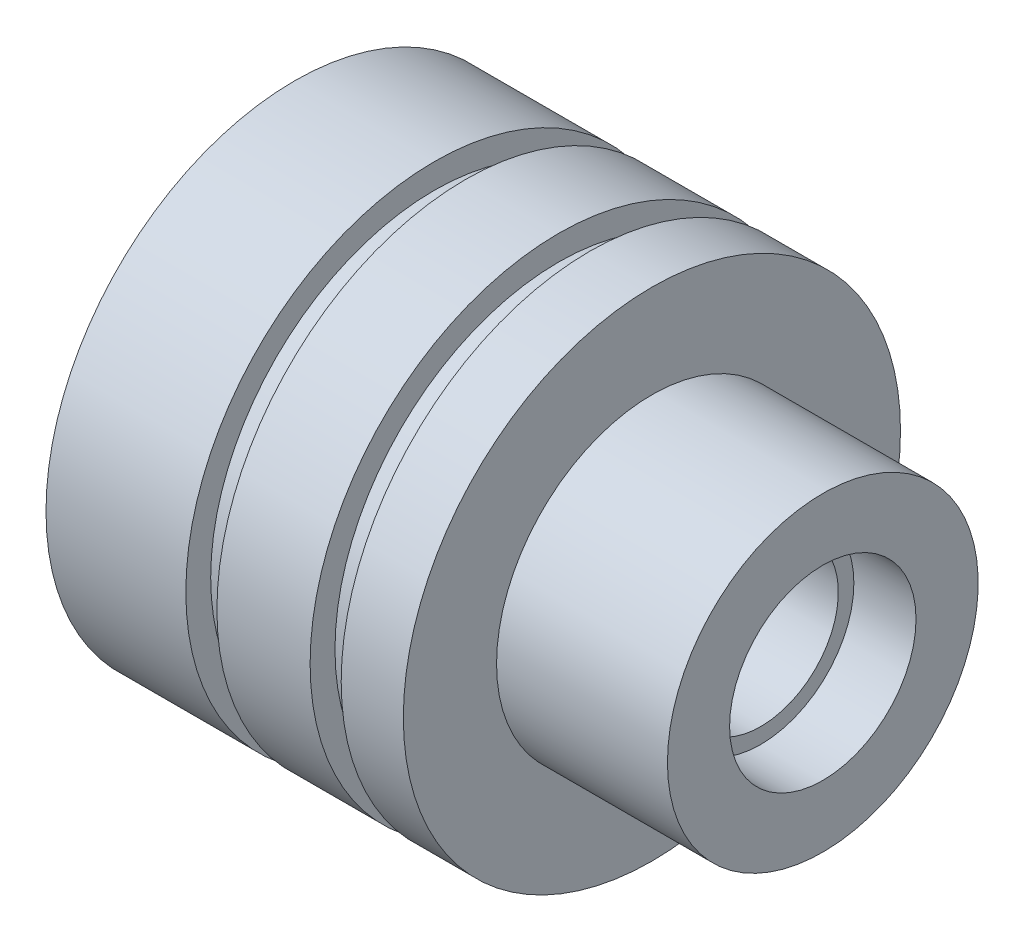
ISO-10303-21;
HEADER;
FILE_DESCRIPTION(('STEP AP214'),'2;1');
FILE_NAME('part.step','',(''),(''),'','','');
FILE_SCHEMA(('AUTOMOTIVE_DESIGN { 1 0 10303 214 1 1 1 1 }'));
ENDSEC;
DATA;
#1=APPLICATION_CONTEXT('core data for automotive mechanical design processes');
#2=APPLICATION_PROTOCOL_DEFINITION('international standard','automotive_design',2000,#1);
#3=PRODUCT_CONTEXT('',#1,'mechanical');
#4=PRODUCT('Part','Part','',(#3));
#5=PRODUCT_RELATED_PRODUCT_CATEGORY('part','',(#4));
#6=PRODUCT_DEFINITION_FORMATION('','',#4);
#7=PRODUCT_DEFINITION_CONTEXT('part definition',#1,'design');
#8=PRODUCT_DEFINITION('design','',#6,#7);
#9=PRODUCT_DEFINITION_SHAPE('','',#8);
#10=(LENGTH_UNIT() NAMED_UNIT(*) SI_UNIT(.MILLI.,.METRE.));
#11=(NAMED_UNIT(*) PLANE_ANGLE_UNIT() SI_UNIT($,.RADIAN.));
#12=(NAMED_UNIT(*) SI_UNIT($,.STERADIAN.) SOLID_ANGLE_UNIT());
#13=UNCERTAINTY_MEASURE_WITH_UNIT(LENGTH_MEASURE(1.E-05),#10,'distance_accuracy_value','');
#14=(GEOMETRIC_REPRESENTATION_CONTEXT(3) GLOBAL_UNCERTAINTY_ASSIGNED_CONTEXT((#13)) GLOBAL_UNIT_ASSIGNED_CONTEXT((#10,
#11,#12)) REPRESENTATION_CONTEXT('',''));
#15=CARTESIAN_POINT('',(0.,0.,0.));
#16=DIRECTION('',(0.,0.,1.));
#17=DIRECTION('',(1.,0.,0.));
#18=AXIS2_PLACEMENT_3D('',#15,#16,#17);
#19=CARTESIAN_POINT('',(0.,0.,0.));
#20=DIRECTION('',(-1.,0.,0.));
#21=DIRECTION('',(0.,0.,1.));
#22=AXIS2_PLACEMENT_3D('',#19,#20,#21);
#23=CYLINDRICAL_SURFACE('',#22,2.5);
#24=CARTESIAN_POINT('',(15.,0.,0.));
#25=DIRECTION('',(-1.,0.,0.));
#26=DIRECTION('',(0.,0.,1.));
#27=AXIS2_PLACEMENT_3D('',#24,#25,#26);
#28=CIRCLE('',#27,2.5);
#29=CARTESIAN_POINT('',(15.,0.,2.5));
#30=VERTEX_POINT('',#29);
#31=EDGE_CURVE('E12',#30,#30,#28,.T.);
#32=ORIENTED_EDGE('',*,*,#31,.F.);
#33=EDGE_LOOP('',(#32));
#34=FACE_BOUND('',#33,.T.);
#35=CARTESIAN_POINT('',(5.6,0.,0.));
#36=DIRECTION('',(-1.,0.,0.));
#37=DIRECTION('',(0.,0.,1.));
#38=AXIS2_PLACEMENT_3D('',#35,#36,#37);
#39=CIRCLE('',#38,2.5);
#40=CARTESIAN_POINT('',(5.6,0.,2.5));
#41=VERTEX_POINT('',#40);
#42=EDGE_CURVE('E98',#41,#41,#39,.T.);
#43=ORIENTED_EDGE('',*,*,#42,.T.);
#44=EDGE_LOOP('',(#43));
#45=FACE_BOUND('',#44,.T.);
#46=ADVANCED_FACE('F40',(#34,#45),#23,.F.);
#47=CARTESIAN_POINT('',(15.,2.5,0.));
#48=DIRECTION('',(-1.,0.,0.));
#49=DIRECTION('',(0.,0.,1.));
#50=AXIS2_PLACEMENT_3D('',#47,#48,#49);
#51=PLANE('',#50);
#52=CARTESIAN_POINT('',(15.,0.,0.));
#53=DIRECTION('',(-1.,0.,0.));
#54=DIRECTION('',(0.,0.,1.));
#55=AXIS2_PLACEMENT_3D('',#52,#53,#54);
#56=CIRCLE('',#55,3.);
#57=CARTESIAN_POINT('',(15.,0.,3.));
#58=VERTEX_POINT('',#57);
#59=EDGE_CURVE('E46',#58,#58,#56,.T.);
#60=ORIENTED_EDGE('',*,*,#59,.F.);
#61=EDGE_LOOP('',(#60));
#62=FACE_BOUND('',#61,.T.);
#63=ORIENTED_EDGE('',*,*,#31,.T.);
#64=EDGE_LOOP('',(#63));
#65=FACE_BOUND('',#64,.T.);
#66=ADVANCED_FACE('F195',(#62,#65),#51,.F.);
#67=CARTESIAN_POINT('',(0.,0.,0.));
#68=DIRECTION('',(-1.,0.,0.));
#69=DIRECTION('',(0.,0.,1.));
#70=AXIS2_PLACEMENT_3D('',#67,#68,#69);
#71=CYLINDRICAL_SURFACE('',#70,3.);
#72=CARTESIAN_POINT('',(17.,0.,0.));
#73=DIRECTION('',(-1.,0.,0.));
#74=DIRECTION('',(0.,0.,1.));
#75=AXIS2_PLACEMENT_3D('',#72,#73,#74);
#76=CIRCLE('',#75,3.);
#77=CARTESIAN_POINT('',(17.,0.,3.));
#78=VERTEX_POINT('',#77);
#79=EDGE_CURVE('E50',#78,#78,#76,.T.);
#80=ORIENTED_EDGE('',*,*,#79,.F.);
#81=EDGE_LOOP('',(#80));
#82=FACE_BOUND('',#81,.T.);
#83=ORIENTED_EDGE('',*,*,#59,.T.);
#84=EDGE_LOOP('',(#83));
#85=FACE_BOUND('',#84,.T.);
#86=ADVANCED_FACE('F190',(#82,#85),#71,.F.);
#87=CARTESIAN_POINT('',(17.,3.,0.));
#88=DIRECTION('',(-1.,0.,0.));
#89=DIRECTION('',(0.,0.,1.));
#90=AXIS2_PLACEMENT_3D('',#87,#88,#89);
#91=PLANE('',#90);
#92=CARTESIAN_POINT('',(17.,0.,0.));
#93=DIRECTION('',(-1.,0.,0.));
#94=DIRECTION('',(0.,0.,1.));
#95=AXIS2_PLACEMENT_3D('',#92,#93,#94);
#96=CIRCLE('',#95,5.);
#97=CARTESIAN_POINT('',(17.,0.,5.));
#98=VERTEX_POINT('',#97);
#99=EDGE_CURVE('E54',#98,#98,#96,.T.);
#100=ORIENTED_EDGE('',*,*,#99,.F.);
#101=EDGE_LOOP('',(#100));
#102=FACE_BOUND('',#101,.T.);
#103=ORIENTED_EDGE('',*,*,#79,.T.);
#104=EDGE_LOOP('',(#103));
#105=FACE_BOUND('',#104,.T.);
#106=ADVANCED_FACE('F184',(#102,#105),#91,.F.);
#107=CARTESIAN_POINT('',(0.,0.,0.));
#108=DIRECTION('',(-1.,0.,0.));
#109=DIRECTION('',(0.,0.,1.));
#110=AXIS2_PLACEMENT_3D('',#107,#108,#109);
#111=CYLINDRICAL_SURFACE('',#110,5.);
#112=CARTESIAN_POINT('',(11.5,0.,0.));
#113=DIRECTION('',(-1.,0.,0.));
#114=DIRECTION('',(0.,0.,1.));
#115=AXIS2_PLACEMENT_3D('',#112,#113,#114);
#116=CIRCLE('',#115,5.);
#117=CARTESIAN_POINT('',(11.5,0.,5.));
#118=VERTEX_POINT('',#117);
#119=EDGE_CURVE('E59',#118,#118,#116,.T.);
#120=ORIENTED_EDGE('',*,*,#119,.F.);
#121=EDGE_LOOP('',(#120));
#122=FACE_BOUND('',#121,.T.);
#123=ORIENTED_EDGE('',*,*,#99,.T.);
#124=EDGE_LOOP('',(#123));
#125=FACE_BOUND('',#124,.T.);
#126=ADVANCED_FACE('F178',(#122,#125),#111,.T.);
#127=CARTESIAN_POINT('',(11.5,5.,0.));
#128=DIRECTION('',(-1.,0.,0.));
#129=DIRECTION('',(0.,0.,1.));
#130=AXIS2_PLACEMENT_3D('',#127,#128,#129);
#131=PLANE('',#130);
#132=CARTESIAN_POINT('',(11.5,0.,0.));
#133=DIRECTION('',(-1.,0.,0.));
#134=DIRECTION('',(0.,0.,1.));
#135=AXIS2_PLACEMENT_3D('',#132,#133,#134);
#136=CIRCLE('',#135,8.);
#137=CARTESIAN_POINT('',(11.5,0.,8.));
#138=VERTEX_POINT('',#137);
#139=EDGE_CURVE('E62',#138,#138,#136,.T.);
#140=ORIENTED_EDGE('',*,*,#139,.F.);
#141=EDGE_LOOP('',(#140));
#142=FACE_BOUND('',#141,.T.);
#143=ORIENTED_EDGE('',*,*,#119,.T.);
#144=EDGE_LOOP('',(#143));
#145=FACE_BOUND('',#144,.T.);
#146=ADVANCED_FACE('F172',(#142,#145),#131,.F.);
#147=CARTESIAN_POINT('',(0.,0.,0.));
#148=DIRECTION('',(-1.,0.,0.));
#149=DIRECTION('',(0.,0.,1.));
#150=AXIS2_PLACEMENT_3D('',#147,#148,#149);
#151=CYLINDRICAL_SURFACE('',#150,8.);
#152=CARTESIAN_POINT('',(9.5,0.,0.));
#153=DIRECTION('',(-1.,0.,0.));
#154=DIRECTION('',(0.,0.,1.));
#155=AXIS2_PLACEMENT_3D('',#152,#153,#154);
#156=CIRCLE('',#155,8.);
#157=CARTESIAN_POINT('',(9.5,0.,8.));
#158=VERTEX_POINT('',#157);
#159=EDGE_CURVE('E65',#158,#158,#156,.T.);
#160=ORIENTED_EDGE('',*,*,#159,.F.);
#161=EDGE_LOOP('',(#160));
#162=FACE_BOUND('',#161,.T.);
#163=ORIENTED_EDGE('',*,*,#139,.T.);
#164=EDGE_LOOP('',(#163));
#165=FACE_BOUND('',#164,.T.);
#166=ADVANCED_FACE('F166',(#162,#165),#151,.T.);
#167=CARTESIAN_POINT('',(9.5,7.2,0.));
#168=DIRECTION('',(1.,0.,0.));
#169=DIRECTION('',(0.,0.,-1.));
#170=AXIS2_PLACEMENT_3D('',#167,#168,#169);
#171=PLANE('',#170);
#172=CARTESIAN_POINT('',(9.5,0.,0.));
#173=DIRECTION('',(-1.,0.,0.));
#174=DIRECTION('',(0.,0.,1.));
#175=AXIS2_PLACEMENT_3D('',#172,#173,#174);
#176=CIRCLE('',#175,7.2);
#177=CARTESIAN_POINT('',(9.5,0.,7.2));
#178=VERTEX_POINT('',#177);
#179=EDGE_CURVE('E68',#178,#178,#176,.T.);
#180=ORIENTED_EDGE('',*,*,#179,.F.);
#181=EDGE_LOOP('',(#180));
#182=FACE_BOUND('',#181,.T.);
#183=ORIENTED_EDGE('',*,*,#159,.T.);
#184=EDGE_LOOP('',(#183));
#185=FACE_BOUND('',#184,.T.);
#186=ADVANCED_FACE('F160',(#182,#185),#171,.F.);
#187=CARTESIAN_POINT('',(0.,0.,0.));
#188=DIRECTION('',(-1.,0.,0.));
#189=DIRECTION('',(0.,0.,1.));
#190=AXIS2_PLACEMENT_3D('',#187,#188,#189);
#191=CYLINDRICAL_SURFACE('',#190,7.2);
#192=CARTESIAN_POINT('',(8.5,0.,0.));
#193=DIRECTION('',(-1.,0.,0.));
#194=DIRECTION('',(0.,0.,1.));
#195=AXIS2_PLACEMENT_3D('',#192,#193,#194);
#196=CIRCLE('',#195,7.2);
#197=CARTESIAN_POINT('',(8.5,0.,7.2));
#198=VERTEX_POINT('',#197);
#199=EDGE_CURVE('E71',#198,#198,#196,.T.);
#200=ORIENTED_EDGE('',*,*,#199,.F.);
#201=EDGE_LOOP('',(#200));
#202=FACE_BOUND('',#201,.T.);
#203=ORIENTED_EDGE('',*,*,#179,.T.);
#204=EDGE_LOOP('',(#203));
#205=FACE_BOUND('',#204,.T.);
#206=ADVANCED_FACE('F154',(#202,#205),#191,.T.);
#207=CARTESIAN_POINT('',(8.5,8.,0.));
#208=DIRECTION('',(-1.,0.,0.));
#209=DIRECTION('',(0.,0.,1.));
#210=AXIS2_PLACEMENT_3D('',#207,#208,#209);
#211=PLANE('',#210);
#212=CARTESIAN_POINT('',(8.5,0.,0.));
#213=DIRECTION('',(-1.,0.,0.));
#214=DIRECTION('',(0.,0.,1.));
#215=AXIS2_PLACEMENT_3D('',#212,#213,#214);
#216=CIRCLE('',#215,8.);
#217=CARTESIAN_POINT('',(8.5,0.,8.));
#218=VERTEX_POINT('',#217);
#219=EDGE_CURVE('E74',#218,#218,#216,.T.);
#220=ORIENTED_EDGE('',*,*,#219,.F.);
#221=EDGE_LOOP('',(#220));
#222=FACE_BOUND('',#221,.T.);
#223=ORIENTED_EDGE('',*,*,#199,.T.);
#224=EDGE_LOOP('',(#223));
#225=FACE_BOUND('',#224,.T.);
#226=ADVANCED_FACE('F148',(#222,#225),#211,.F.);
#227=CARTESIAN_POINT('',(0.,0.,0.));
#228=DIRECTION('',(-1.,0.,0.));
#229=DIRECTION('',(0.,0.,1.));
#230=AXIS2_PLACEMENT_3D('',#227,#228,#229);
#231=CYLINDRICAL_SURFACE('',#230,8.);
#232=CARTESIAN_POINT('',(5.5,0.,0.));
#233=DIRECTION('',(-1.,0.,0.));
#234=DIRECTION('',(0.,0.,1.));
#235=AXIS2_PLACEMENT_3D('',#232,#233,#234);
#236=CIRCLE('',#235,8.);
#237=CARTESIAN_POINT('',(5.5,0.,8.));
#238=VERTEX_POINT('',#237);
#239=EDGE_CURVE('E77',#238,#238,#236,.T.);
#240=ORIENTED_EDGE('',*,*,#239,.F.);
#241=EDGE_LOOP('',(#240));
#242=FACE_BOUND('',#241,.T.);
#243=ORIENTED_EDGE('',*,*,#219,.T.);
#244=EDGE_LOOP('',(#243));
#245=FACE_BOUND('',#244,.T.);
#246=ADVANCED_FACE('F142',(#242,#245),#231,.T.);
#247=CARTESIAN_POINT('',(5.5,7.2,0.));
#248=DIRECTION('',(1.,0.,0.));
#249=DIRECTION('',(0.,0.,-1.));
#250=AXIS2_PLACEMENT_3D('',#247,#248,#249);
#251=PLANE('',#250);
#252=CARTESIAN_POINT('',(5.5,0.,0.));
#253=DIRECTION('',(-1.,0.,0.));
#254=DIRECTION('',(0.,0.,1.));
#255=AXIS2_PLACEMENT_3D('',#252,#253,#254);
#256=CIRCLE('',#255,7.2);
#257=CARTESIAN_POINT('',(5.5,0.,7.2));
#258=VERTEX_POINT('',#257);
#259=EDGE_CURVE('E80',#258,#258,#256,.T.);
#260=ORIENTED_EDGE('',*,*,#259,.F.);
#261=EDGE_LOOP('',(#260));
#262=FACE_BOUND('',#261,.T.);
#263=ORIENTED_EDGE('',*,*,#239,.T.);
#264=EDGE_LOOP('',(#263));
#265=FACE_BOUND('',#264,.T.);
#266=ADVANCED_FACE('F136',(#262,#265),#251,.F.);
#267=CARTESIAN_POINT('',(0.,0.,0.));
#268=DIRECTION('',(-1.,0.,0.));
#269=DIRECTION('',(0.,0.,1.));
#270=AXIS2_PLACEMENT_3D('',#267,#268,#269);
#271=CYLINDRICAL_SURFACE('',#270,7.2);
#272=CARTESIAN_POINT('',(4.5,0.,0.));
#273=DIRECTION('',(-1.,0.,0.));
#274=DIRECTION('',(0.,0.,1.));
#275=AXIS2_PLACEMENT_3D('',#272,#273,#274);
#276=CIRCLE('',#275,7.2);
#277=CARTESIAN_POINT('',(4.5,0.,7.2));
#278=VERTEX_POINT('',#277);
#279=EDGE_CURVE('E83',#278,#278,#276,.T.);
#280=ORIENTED_EDGE('',*,*,#279,.F.);
#281=EDGE_LOOP('',(#280));
#282=FACE_BOUND('',#281,.T.);
#283=ORIENTED_EDGE('',*,*,#259,.T.);
#284=EDGE_LOOP('',(#283));
#285=FACE_BOUND('',#284,.T.);
#286=ADVANCED_FACE('F130',(#282,#285),#271,.T.);
#287=CARTESIAN_POINT('',(4.5,8.,0.));
#288=DIRECTION('',(-1.,0.,0.));
#289=DIRECTION('',(0.,0.,1.));
#290=AXIS2_PLACEMENT_3D('',#287,#288,#289);
#291=PLANE('',#290);
#292=CARTESIAN_POINT('',(4.5,0.,0.));
#293=DIRECTION('',(-1.,0.,0.));
#294=DIRECTION('',(0.,0.,1.));
#295=AXIS2_PLACEMENT_3D('',#292,#293,#294);
#296=CIRCLE('',#295,8.);
#297=CARTESIAN_POINT('',(4.5,0.,8.));
#298=VERTEX_POINT('',#297);
#299=EDGE_CURVE('E86',#298,#298,#296,.T.);
#300=ORIENTED_EDGE('',*,*,#299,.F.);
#301=EDGE_LOOP('',(#300));
#302=FACE_BOUND('',#301,.T.);
#303=ORIENTED_EDGE('',*,*,#279,.T.);
#304=EDGE_LOOP('',(#303));
#305=FACE_BOUND('',#304,.T.);
#306=ADVANCED_FACE('F124',(#302,#305),#291,.F.);
#307=CARTESIAN_POINT('',(0.,0.,0.));
#308=DIRECTION('',(-1.,0.,0.));
#309=DIRECTION('',(0.,0.,1.));
#310=AXIS2_PLACEMENT_3D('',#307,#308,#309);
#311=CYLINDRICAL_SURFACE('',#310,8.);
#312=CARTESIAN_POINT('',(0.,0.,0.));
#313=DIRECTION('',(-1.,0.,0.));
#314=DIRECTION('',(0.,0.,1.));
#315=AXIS2_PLACEMENT_3D('',#312,#313,#314);
#316=CIRCLE('',#315,8.);
#317=CARTESIAN_POINT('',(0.,0.,8.));
#318=VERTEX_POINT('',#317);
#319=EDGE_CURVE('E89',#318,#318,#316,.T.);
#320=ORIENTED_EDGE('',*,*,#319,.F.);
#321=EDGE_LOOP('',(#320));
#322=FACE_BOUND('',#321,.T.);
#323=ORIENTED_EDGE('',*,*,#299,.T.);
#324=EDGE_LOOP('',(#323));
#325=FACE_BOUND('',#324,.T.);
#326=ADVANCED_FACE('F118',(#322,#325),#311,.T.);
#327=CARTESIAN_POINT('',(0.,8.,0.));
#328=DIRECTION('',(1.,0.,0.));
#329=DIRECTION('',(0.,0.,-1.));
#330=AXIS2_PLACEMENT_3D('',#327,#328,#329);
#331=PLANE('',#330);
#332=CARTESIAN_POINT('',(0.,0.,0.));
#333=DIRECTION('',(-1.,0.,0.));
#334=DIRECTION('',(0.,0.,1.));
#335=AXIS2_PLACEMENT_3D('',#332,#333,#334);
#336=CIRCLE('',#335,5.);
#337=CARTESIAN_POINT('',(0.,0.,5.));
#338=VERTEX_POINT('',#337);
#339=EDGE_CURVE('E92',#338,#338,#336,.T.);
#340=ORIENTED_EDGE('',*,*,#339,.F.);
#341=EDGE_LOOP('',(#340));
#342=FACE_BOUND('',#341,.T.);
#343=ORIENTED_EDGE('',*,*,#319,.T.);
#344=EDGE_LOOP('',(#343));
#345=FACE_BOUND('',#344,.T.);
#346=ADVANCED_FACE('F112',(#342,#345),#331,.F.);
#347=CARTESIAN_POINT('',(0.,0.,0.));
#348=DIRECTION('',(-1.,0.,0.));
#349=DIRECTION('',(0.,0.,1.));
#350=AXIS2_PLACEMENT_3D('',#347,#348,#349);
#351=CYLINDRICAL_SURFACE('',#350,5.);
#352=CARTESIAN_POINT('',(5.6,0.,0.));
#353=DIRECTION('',(-1.,0.,0.));
#354=DIRECTION('',(0.,0.,1.));
#355=AXIS2_PLACEMENT_3D('',#352,#353,#354);
#356=CIRCLE('',#355,5.);
#357=CARTESIAN_POINT('',(5.6,0.,5.));
#358=VERTEX_POINT('',#357);
#359=EDGE_CURVE('E95',#358,#358,#356,.T.);
#360=ORIENTED_EDGE('',*,*,#359,.F.);
#361=EDGE_LOOP('',(#360));
#362=FACE_BOUND('',#361,.T.);
#363=ORIENTED_EDGE('',*,*,#339,.T.);
#364=EDGE_LOOP('',(#363));
#365=FACE_BOUND('',#364,.T.);
#366=ADVANCED_FACE('F106',(#362,#365),#351,.F.);
#367=CARTESIAN_POINT('',(5.6,5.,0.));
#368=DIRECTION('',(1.,0.,0.));
#369=DIRECTION('',(0.,0.,-1.));
#370=AXIS2_PLACEMENT_3D('',#367,#368,#369);
#371=PLANE('',#370);
#372=ORIENTED_EDGE('',*,*,#42,.F.);
#373=EDGE_LOOP('',(#372));
#374=FACE_BOUND('',#373,.T.);
#375=ORIENTED_EDGE('',*,*,#359,.T.);
#376=EDGE_LOOP('',(#375));
#377=FACE_BOUND('',#376,.T.);
#378=ADVANCED_FACE('F103',(#374,#377),#371,.F.);
#379=CLOSED_SHELL('',(#46,#66,#86,#106,#126,#146,#166,#186,#206,#226,#246,#266,#286,#306,#326,
#346,#366,#378));
#380=MANIFOLD_SOLID_BREP('B2',#379);
#381=ADVANCED_BREP_SHAPE_REPRESENTATION('',(#18,#380),#14);
#382=SHAPE_DEFINITION_REPRESENTATION(#9,#381);
ENDSEC;
END-ISO-10303-21;
